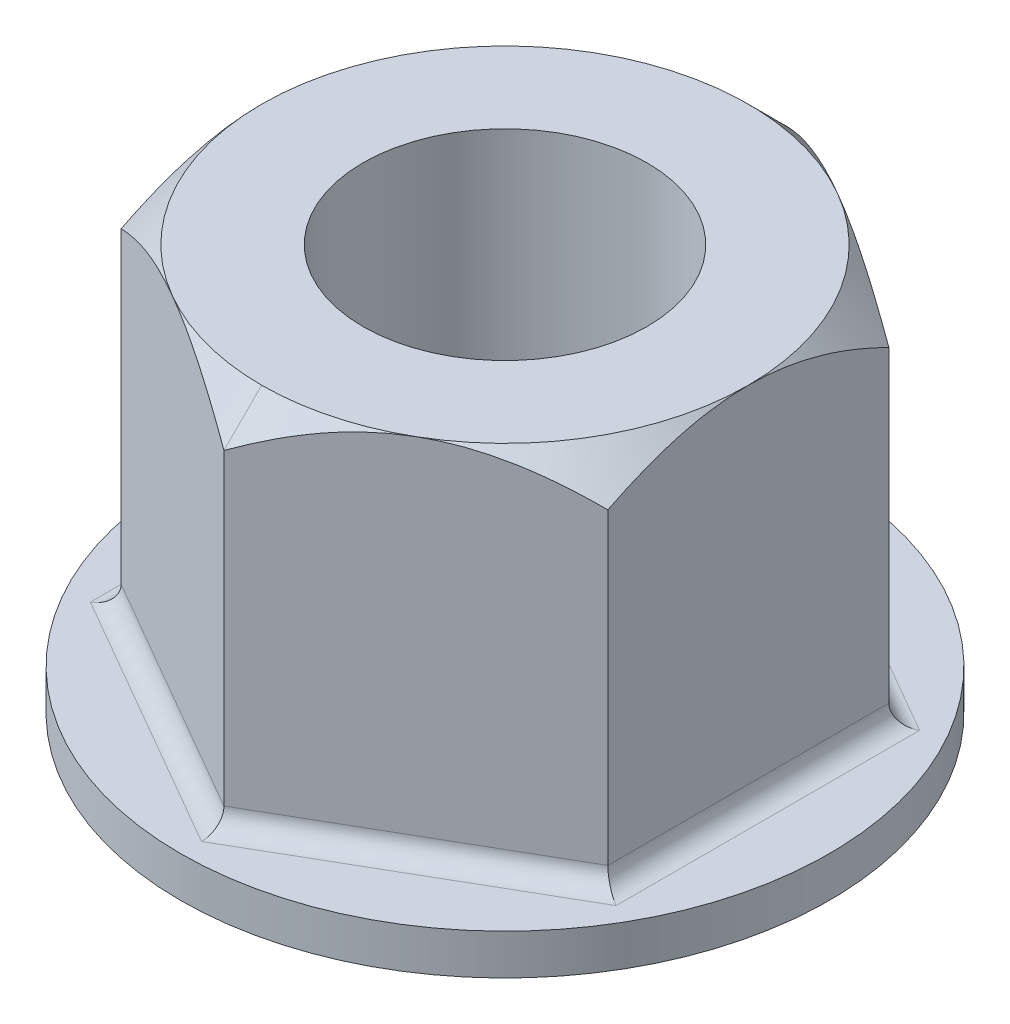
ISO-10303-21;
HEADER;
FILE_DESCRIPTION(('STEP AP214'),'2;1');
FILE_NAME('part.step','',(''),(''),'','','');
FILE_SCHEMA(('AUTOMOTIVE_DESIGN { 1 0 10303 214 1 1 1 1 }'));
ENDSEC;
DATA;
#1=APPLICATION_CONTEXT('core data for automotive mechanical design processes');
#2=APPLICATION_PROTOCOL_DEFINITION('international standard','automotive_design',2000,#1);
#3=PRODUCT_CONTEXT('',#1,'mechanical');
#4=PRODUCT('Part','Part','',(#3));
#5=PRODUCT_RELATED_PRODUCT_CATEGORY('part','',(#4));
#6=PRODUCT_DEFINITION_FORMATION('','',#4);
#7=PRODUCT_DEFINITION_CONTEXT('part definition',#1,'design');
#8=PRODUCT_DEFINITION('design','',#6,#7);
#9=PRODUCT_DEFINITION_SHAPE('','',#8);
#10=(LENGTH_UNIT() NAMED_UNIT(*) SI_UNIT(.MILLI.,.METRE.));
#11=(NAMED_UNIT(*) PLANE_ANGLE_UNIT() SI_UNIT($,.RADIAN.));
#12=(NAMED_UNIT(*) SI_UNIT($,.STERADIAN.) SOLID_ANGLE_UNIT());
#13=UNCERTAINTY_MEASURE_WITH_UNIT(LENGTH_MEASURE(1.E-05),#10,'distance_accuracy_value','');
#14=(GEOMETRIC_REPRESENTATION_CONTEXT(3) GLOBAL_UNCERTAINTY_ASSIGNED_CONTEXT((#13)) GLOBAL_UNIT_ASSIGNED_CONTEXT((#10,
#11,#12)) REPRESENTATION_CONTEXT('',''));
#15=CARTESIAN_POINT('',(0.,0.,0.));
#16=DIRECTION('',(0.,0.,1.));
#17=DIRECTION('',(1.,0.,0.));
#18=AXIS2_PLACEMENT_3D('',#15,#16,#17);
#19=CARTESIAN_POINT('',(0.,31.75,0.));
#20=DIRECTION('',(0.,1.,0.));
#21=DIRECTION('',(0.,0.,1.));
#22=AXIS2_PLACEMENT_3D('',#19,#20,#21);
#23=PLANE('',#22);
#24=CARTESIAN_POINT('',(0.,31.75,0.));
#25=DIRECTION('',(0.,1.,0.));
#26=DIRECTION('',(0.,0.,1.));
#27=AXIS2_PLACEMENT_3D('',#24,#25,#26);
#28=CIRCLE('',#27,11.1125);
#29=CARTESIAN_POINT('',(0.,31.75,11.1125));
#30=VERTEX_POINT('',#29);
#31=EDGE_CURVE('E317',#30,#30,#28,.T.);
#32=ORIENTED_EDGE('',*,*,#31,.F.);
#33=EDGE_LOOP('',(#32));
#34=FACE_BOUND('',#33,.T.);
#35=CARTESIAN_POINT('',(0.,31.75,0.));
#36=DIRECTION('',(0.,1.,0.));
#37=DIRECTION('',(0.,0.,1.));
#38=AXIS2_PLACEMENT_3D('',#35,#36,#37);
#39=CIRCLE('',#38,19.05);
#40=CARTESIAN_POINT('',(0.,31.75,19.05));
#41=VERTEX_POINT('',#40);
#42=CARTESIAN_POINT('',(9.525,31.75,16.4977839420936));
#43=VERTEX_POINT('',#42);
#44=EDGE_CURVE('E160',#41,#43,#39,.T.);
#45=ORIENTED_EDGE('',*,*,#44,.T.);
#46=CARTESIAN_POINT('',(19.05,31.75,0.));
#47=VERTEX_POINT('',#46);
#48=EDGE_CURVE('E209',#43,#47,#39,.T.);
#49=ORIENTED_EDGE('',*,*,#48,.T.);
#50=CARTESIAN_POINT('',(9.525,31.75,-16.4977839420936));
#51=VERTEX_POINT('',#50);
#52=EDGE_CURVE('E323',#47,#51,#39,.T.);
#53=ORIENTED_EDGE('',*,*,#52,.T.);
#54=CARTESIAN_POINT('',(-9.525,31.75,-16.4977839420936));
#55=VERTEX_POINT('',#54);
#56=EDGE_CURVE('E330',#51,#55,#39,.T.);
#57=ORIENTED_EDGE('',*,*,#56,.T.);
#58=CARTESIAN_POINT('',(-19.05,31.75,0.));
#59=VERTEX_POINT('',#58);
#60=EDGE_CURVE('E327',#55,#59,#39,.T.);
#61=ORIENTED_EDGE('',*,*,#60,.T.);
#62=CARTESIAN_POINT('',(-9.52500000000001,31.75,16.4977839420936));
#63=VERTEX_POINT('',#62);
#64=EDGE_CURVE('E325',#59,#63,#39,.T.);
#65=ORIENTED_EDGE('',*,*,#64,.T.);
#66=EDGE_CURVE('E145',#63,#41,#39,.T.);
#67=ORIENTED_EDGE('',*,*,#66,.T.);
#68=EDGE_LOOP('',(#45,#49,#53,#57,#61,#65,#67));
#69=FACE_BOUND('',#68,.T.);
#70=ADVANCED_FACE('F44',(#34,#69),#23,.T.);
#71=CARTESIAN_POINT('',(0.,3.175,0.));
#72=DIRECTION('',(0.,-1.,0.));
#73=DIRECTION('',(0.,0.,-1.));
#74=AXIS2_PLACEMENT_3D('',#71,#72,#73);
#75=CYLINDRICAL_SURFACE('',#74,25.4);
#76=CARTESIAN_POINT('',(0.,3.175,0.));
#77=DIRECTION('',(0.,1.,0.));
#78=DIRECTION('',(0.,0.,1.));
#79=AXIS2_PLACEMENT_3D('',#76,#77,#78);
#80=CIRCLE('',#79,25.4);
#81=CARTESIAN_POINT('',(0.,3.175,25.4));
#82=VERTEX_POINT('',#81);
#83=EDGE_CURVE('E191',#82,#82,#80,.T.);
#84=ORIENTED_EDGE('',*,*,#83,.F.);
#85=EDGE_LOOP('',(#84));
#86=FACE_BOUND('',#85,.T.);
#87=CARTESIAN_POINT('',(0.,0.,0.));
#88=DIRECTION('',(0.,1.,0.));
#89=DIRECTION('',(0.,0.,1.));
#90=AXIS2_PLACEMENT_3D('',#87,#88,#89);
#91=CIRCLE('',#90,25.4);
#92=CARTESIAN_POINT('',(0.,0.,25.4));
#93=VERTEX_POINT('',#92);
#94=EDGE_CURVE('E190',#93,#93,#91,.T.);
#95=ORIENTED_EDGE('',*,*,#94,.T.);
#96=EDGE_LOOP('',(#95));
#97=FACE_BOUND('',#96,.T.);
#98=ADVANCED_FACE('F278',(#86,#97),#75,.T.);
#99=CARTESIAN_POINT('',(0.,3.175,0.));
#100=DIRECTION('',(0.,1.,0.));
#101=DIRECTION('',(0.,0.,1.));
#102=AXIS2_PLACEMENT_3D('',#99,#100,#101);
#103=PLANE('',#102);
#104=DIRECTION('',(-0.866025403784439,0.,0.5));
#105=VECTOR('',#104,1.);
#106=CARTESIAN_POINT('',(-10.287,3.175,-17.8176066574611));
#107=LINE('',#106,#105);
#108=CARTESIAN_POINT('',(-20.574,3.175,-11.8784044383074));
#109=VERTEX_POINT('',#108);
#110=CARTESIAN_POINT('',(0.,3.175,-23.7568088766147));
#111=VERTEX_POINT('',#110);
#112=EDGE_CURVE('E364',#109,#111,#107,.F.);
#113=ORIENTED_EDGE('',*,*,#112,.T.);
#114=DIRECTION('',(-0.866025403784439,0.,-0.5));
#115=VECTOR('',#114,1.);
#116=CARTESIAN_POINT('',(10.287,3.175,-17.8176066574611));
#117=LINE('',#116,#115);
#118=CARTESIAN_POINT('',(20.574,3.175,-11.8784044383074));
#119=VERTEX_POINT('',#118);
#120=EDGE_CURVE('E367',#111,#119,#117,.F.);
#121=ORIENTED_EDGE('',*,*,#120,.T.);
#122=DIRECTION('',(0.,0.,-1.));
#123=VECTOR('',#122,1.);
#124=CARTESIAN_POINT('',(20.574,3.175,0.));
#125=LINE('',#124,#123);
#126=CARTESIAN_POINT('',(20.574,3.175,11.8784044383074));
#127=VERTEX_POINT('',#126);
#128=EDGE_CURVE('E352',#119,#127,#125,.F.);
#129=ORIENTED_EDGE('',*,*,#128,.T.);
#130=DIRECTION('',(0.866025403784439,0.,-0.5));
#131=VECTOR('',#130,1.);
#132=CARTESIAN_POINT('',(10.287,3.175,17.8176066574611));
#133=LINE('',#132,#131);
#134=CARTESIAN_POINT('',(0.,3.175,23.7568088766147));
#135=VERTEX_POINT('',#134);
#136=EDGE_CURVE('E348',#127,#135,#133,.F.);
#137=ORIENTED_EDGE('',*,*,#136,.T.);
#138=DIRECTION('',(0.866025403784439,0.,0.5));
#139=VECTOR('',#138,1.);
#140=CARTESIAN_POINT('',(-10.287,3.175,17.817606657461));
#141=LINE('',#140,#139);
#142=CARTESIAN_POINT('',(-20.574,3.175,11.8784044383074));
#143=VERTEX_POINT('',#142);
#144=EDGE_CURVE('E356',#135,#143,#141,.F.);
#145=ORIENTED_EDGE('',*,*,#144,.T.);
#146=DIRECTION('',(0.,0.,1.));
#147=VECTOR('',#146,1.);
#148=CARTESIAN_POINT('',(-20.574,3.175,0.));
#149=LINE('',#148,#147);
#150=EDGE_CURVE('E361',#143,#109,#149,.F.);
#151=ORIENTED_EDGE('',*,*,#150,.T.);
#152=EDGE_LOOP('',(#113,#121,#129,#137,#145,#151));
#153=FACE_BOUND('',#152,.T.);
#154=ORIENTED_EDGE('',*,*,#83,.T.);
#155=EDGE_LOOP('',(#154));
#156=FACE_BOUND('',#155,.T.);
#157=ADVANCED_FACE('F275',(#153,#156),#103,.T.);
#158=CARTESIAN_POINT('',(0.,0.,0.));
#159=DIRECTION('',(0.,1.,0.));
#160=DIRECTION('',(0.,0.,1.));
#161=AXIS2_PLACEMENT_3D('',#158,#159,#160);
#162=PLANE('',#161);
#163=CARTESIAN_POINT('',(0.,0.,0.));
#164=DIRECTION('',(0.,1.,0.));
#165=DIRECTION('',(0.,0.,1.));
#166=AXIS2_PLACEMENT_3D('',#163,#164,#165);
#167=CIRCLE('',#166,11.1125);
#168=CARTESIAN_POINT('',(0.,0.,11.1125));
#169=VERTEX_POINT('',#168);
#170=EDGE_CURVE('E412',#169,#169,#167,.T.);
#171=ORIENTED_EDGE('',*,*,#170,.T.);
#172=EDGE_LOOP('',(#171));
#173=FACE_BOUND('',#172,.T.);
#174=ORIENTED_EDGE('',*,*,#94,.F.);
#175=EDGE_LOOP('',(#174));
#176=FACE_BOUND('',#175,.T.);
#177=ADVANCED_FACE('F273',(#173,#176),#162,.F.);
#178=CARTESIAN_POINT('',(19.05,31.75,-10.9985226280624));
#179=DIRECTION('',(-0.5,0.,0.866025403784439));
#180=DIRECTION('',(0.866025403784439,0.,0.5));
#181=AXIS2_PLACEMENT_3D('',#178,#179,#180);
#182=PLANE('',#181);
#183=DIRECTION('',(0.,-1.,0.));
#184=VECTOR('',#183,1.);
#185=CARTESIAN_POINT('',(19.05,31.75,-10.9985226280624));
#186=LINE('',#185,#184);
#187=CARTESIAN_POINT('',(19.05,28.8029547438752,-10.9985226280624));
#188=VERTEX_POINT('',#187);
#189=CARTESIAN_POINT('',(19.05,4.699,-10.9985226280624));
#190=VERTEX_POINT('',#189);
#191=EDGE_CURVE('E179',#188,#190,#186,.T.);
#192=ORIENTED_EDGE('',*,*,#191,.T.);
#193=DIRECTION('',(-0.866025403784439,0.,-0.5));
#194=VECTOR('',#193,1.);
#195=CARTESIAN_POINT('',(19.05,4.699,-10.9985226280624));
#196=LINE('',#195,#194);
#197=CARTESIAN_POINT('',(0.,4.699,-21.9970452561248));
#198=VERTEX_POINT('',#197);
#199=EDGE_CURVE('E210',#190,#198,#196,.T.);
#200=ORIENTED_EDGE('',*,*,#199,.T.);
#201=DIRECTION('',(0.,-1.,0.));
#202=VECTOR('',#201,1.);
#203=CARTESIAN_POINT('',(0.,31.75,-21.9970452561248));
#204=LINE('',#203,#202);
#205=CARTESIAN_POINT('',(0.,28.8029547438752,-21.9970452561247));
#206=VERTEX_POINT('',#205);
#207=EDGE_CURVE('E186',#206,#198,#204,.T.);
#208=ORIENTED_EDGE('',*,*,#207,.F.);
#209=CARTESIAN_POINT('',(-0.00019999999999619,28.8028392729122,-21.9971607261786));
#210=CARTESIAN_POINT('',(0.327307732027853,28.9918962987115,-21.8080740489306));
#211=CARTESIAN_POINT('',(0.657380380364392,29.1751842269532,-21.6175065165614));
#212=CARTESIAN_POINT('',(1.32305466946838,29.5283893912222,-21.2331792865546));
#213=CARTESIAN_POINT('',(1.65865921042914,29.6982993253289,-21.0394179144896));
#214=CARTESIAN_POINT('',(2.33737928125244,30.0236355332472,-20.6475586988954));
#215=CARTESIAN_POINT('',(2.68052681344622,30.1789733121749,-20.4494423788116));
#216=CARTESIAN_POINT('',(3.37245805918866,30.4717914126347,-20.0499556878215));
#217=CARTESIAN_POINT('',(3.7212409018745,30.6092744642549,-19.8485858197081));
#218=CARTESIAN_POINT('',(4.41883366262479,30.8620334763728,-19.4458304515042));
#219=CARTESIAN_POINT('',(4.76755786914356,30.9776230809991,-19.2444944369976));
#220=CARTESIAN_POINT('',(5.46989855210758,31.1868865697012,-18.8389978546255));
#221=CARTESIAN_POINT('',(5.82351450740406,31.2805627695932,-18.6348375876453));
#222=CARTESIAN_POINT('',(6.53410992186082,31.4436454476321,-18.2245751338238));
#223=CARTESIAN_POINT('',(6.89107991548761,31.5131065748416,-18.0184784119108));
#224=CARTESIAN_POINT('',(7.60806155278002,31.626215439315,-17.604528870616));
#225=CARTESIAN_POINT('',(7.96807273380851,31.6698670335719,-17.3966763183379));
#226=CARTESIAN_POINT('',(8.58712817548344,31.7215630271627,-17.0392644924436));
#227=CARTESIAN_POINT('',(8.84577151718196,31.7362031132703,-16.8899366894898));
#228=CARTESIAN_POINT('',(9.36336376438763,31.7514270055186,-16.5911046662352));
#229=CARTESIAN_POINT('',(9.62231265319662,31.752011547173,-16.4416004555749));
#230=CARTESIAN_POINT('',(10.1400382130409,31.7391103316326,-16.1426914642325));
#231=CARTESIAN_POINT('',(10.3988147879055,31.7256194850546,-15.9932867390744));
#232=CARTESIAN_POINT('',(10.9155459764408,31.684768844215,-15.6949518482749));
#233=CARTESIAN_POINT('',(11.1735005759425,31.6574088121667,-15.5460216908139));
#234=CARTESIAN_POINT('',(11.688332666634,31.5891893810182,-15.2487832446657));
#235=CARTESIAN_POINT('',(11.9452087876488,31.5483162146379,-15.1004757470494));
#236=CARTESIAN_POINT('',(12.4571792752921,31.4536603823693,-14.8048894481915));
#237=CARTESIAN_POINT('',(12.7122734343267,31.3998762373715,-14.6576107668041));
#238=CARTESIAN_POINT('',(13.4741914374319,31.2202115855567,-14.2177172026109));
#239=CARTESIAN_POINT('',(13.9778428365935,31.0759925174332,-13.9269339317272));
#240=CARTESIAN_POINT('',(14.8717931017015,30.7793074195576,-13.410811505525));
#241=CARTESIAN_POINT('',(15.2640888283327,30.6346465439819,-13.1843194621525));
#242=CARTESIAN_POINT('',(16.0416538106179,30.3220148853287,-12.7353921103177));
#243=CARTESIAN_POINT('',(16.4269228536301,30.154043398144,-12.5129569246242));
#244=CARTESIAN_POINT('',(17.1892019617876,29.7985558495717,-12.0728548763318));
#245=CARTESIAN_POINT('',(17.5662337172492,29.6111012557993,-11.8551754908231));
#246=CARTESIAN_POINT('',(18.3133164094597,29.2191078968787,-11.4238470973684));
#247=CARTESIAN_POINT('',(18.6833714572333,29.0145796042933,-11.2101957159213));
#248=CARTESIAN_POINT('',(19.0502,28.8028392729122,-10.9984071580086));
#249=B_SPLINE_CURVE_WITH_KNOTS('',3,(#209,#210,#211,#212,#213,#214,#215,#216,#217,#218,#219,
#220,#221,#222,#223,#224,#225,#226,#227,#228,#229,#230,#231,#232,#233,#234,#235,#236,#237,#238,
#239,#240,#241,#242,#243,#244,#245,#246,#247,#248),.UNSPECIFIED.,.F.,.F.,(4,2,2,2,2,2,2,2,2,2,2,
2,2,2,2,2,2,2,2,4),(0.,1.26844596722019,2.53757954078811,3.81397944669045,5.09018395350597,
6.34643183621876,7.60254689818057,8.85580849817683,10.1088827625971,11.0056189577351,
11.9023082273929,12.7993218346277,13.6963508216572,14.5942965392257,15.4923451765124,
17.2877747306613,18.7137121331068,20.1396926159926,21.5613034713831,22.9820486660288),.UNSPECIFIED.);
#250=EDGE_CURVE('E168',#206,#51,#249,.T.);
#251=ORIENTED_EDGE('',*,*,#250,.T.);
#252=EDGE_CURVE('E236',#51,#188,#249,.T.);
#253=ORIENTED_EDGE('',*,*,#252,.T.);
#254=EDGE_LOOP('',(#192,#200,#208,#251,#253));
#255=FACE_BOUND('',#254,.T.);
#256=ADVANCED_FACE('F267',(#255),#182,.F.);
#257=CARTESIAN_POINT('',(0.,31.75,-21.9970452561248));
#258=DIRECTION('',(0.5,0.,0.866025403784439));
#259=DIRECTION('',(0.866025403784439,0.,-0.5));
#260=AXIS2_PLACEMENT_3D('',#257,#258,#259);
#261=PLANE('',#260);
#262=ORIENTED_EDGE('',*,*,#207,.T.);
#263=DIRECTION('',(-0.866025403784439,0.,0.5));
#264=VECTOR('',#263,1.);
#265=CARTESIAN_POINT('',(0.,4.699,-21.9970452561248));
#266=LINE('',#265,#264);
#267=CARTESIAN_POINT('',(-19.05,4.699,-10.9985226280624));
#268=VERTEX_POINT('',#267);
#269=EDGE_CURVE('E371',#198,#268,#266,.T.);
#270=ORIENTED_EDGE('',*,*,#269,.T.);
#271=DIRECTION('',(0.,-1.,0.));
#272=VECTOR('',#271,1.);
#273=CARTESIAN_POINT('',(-19.05,31.75,-10.9985226280624));
#274=LINE('',#273,#272);
#275=CARTESIAN_POINT('',(-19.05,28.8029547438752,-10.9985226280624));
#276=VERTEX_POINT('',#275);
#277=EDGE_CURVE('E177',#276,#268,#274,.T.);
#278=ORIENTED_EDGE('',*,*,#277,.F.);
#279=CARTESIAN_POINT('',(-19.0502,28.8028392729122,-10.9984071580085));
#280=CARTESIAN_POINT('',(-18.7226922679722,28.9918962987115,-11.1874938352565));
#281=CARTESIAN_POINT('',(-18.3926196196356,29.1751842269532,-11.3780613676257));
#282=CARTESIAN_POINT('',(-17.7269453305316,29.5283893912222,-11.7623885976325));
#283=CARTESIAN_POINT('',(-17.3913407895709,29.6982993253289,-11.9561499696975));
#284=CARTESIAN_POINT('',(-16.7126207187476,30.0236355332472,-12.3480091852917));
#285=CARTESIAN_POINT('',(-16.3694731865538,30.1789733121749,-12.5461255053756));
#286=CARTESIAN_POINT('',(-15.6775419408113,30.4717914126347,-12.9456121963657));
#287=CARTESIAN_POINT('',(-15.3287590981255,30.6092744642549,-13.1469820644791));
#288=CARTESIAN_POINT('',(-14.6311663373752,30.8620334763728,-13.549737432683));
#289=CARTESIAN_POINT('',(-14.2824421308564,30.9776230809991,-13.7510734471895));
#290=CARTESIAN_POINT('',(-13.5801014478924,31.1868865697012,-14.1565700295616));
#291=CARTESIAN_POINT('',(-13.2264854925959,31.2805627695932,-14.3607302965418));
#292=CARTESIAN_POINT('',(-12.5158900781392,31.4436454476321,-14.7709927503633));
#293=CARTESIAN_POINT('',(-12.1589200845124,31.5131065748416,-14.9770894722764));
#294=CARTESIAN_POINT('',(-11.44193844722,31.626215439315,-15.3910390135712));
#295=CARTESIAN_POINT('',(-11.0819272661915,31.6698670335719,-15.5988915658492));
#296=CARTESIAN_POINT('',(-10.4628718245166,31.7215630271627,-15.9563033917436));
#297=CARTESIAN_POINT('',(-10.204228482818,31.7362031132703,-16.1056311946973));
#298=CARTESIAN_POINT('',(-9.68663623561237,31.7514270055186,-16.404463217952));
#299=CARTESIAN_POINT('',(-9.42768734680338,31.752011547173,-16.5539674286122));
#300=CARTESIAN_POINT('',(-8.90996178695911,31.7391103316326,-16.8528764199546));
#301=CARTESIAN_POINT('',(-8.65118521209449,31.7256194850546,-17.0022811451127));
#302=CARTESIAN_POINT('',(-8.13445402355919,31.684768844215,-17.3006160359122));
#303=CARTESIAN_POINT('',(-7.87649942405754,31.6574088121667,-17.4495461933732));
#304=CARTESIAN_POINT('',(-7.36166733336605,31.5891893810182,-17.7467846395214));
#305=CARTESIAN_POINT('',(-7.10479121235116,31.5483162146379,-17.8950921371377));
#306=CARTESIAN_POINT('',(-6.59282072470793,31.4536603823693,-18.1906784359957));
#307=CARTESIAN_POINT('',(-6.33772656567326,31.3998762373715,-18.3379571173831));
#308=CARTESIAN_POINT('',(-5.57580856256813,31.2202115855567,-18.7778506815762));
#309=CARTESIAN_POINT('',(-5.07215716340653,31.0759925174332,-19.0686339524599));
#310=CARTESIAN_POINT('',(-4.17820689829847,30.7793074195576,-19.5847563786622));
#311=CARTESIAN_POINT('',(-3.78591117166731,30.6346465439819,-19.8112484220346));
#312=CARTESIAN_POINT('',(-3.00834618938205,30.3220148853287,-20.2601757738694));
#313=CARTESIAN_POINT('',(-2.62307714636987,30.154043398144,-20.4826109595629));
#314=CARTESIAN_POINT('',(-1.86079803821235,29.7985558495717,-20.9227130078553));
#315=CARTESIAN_POINT('',(-1.48376628275081,29.6111012557993,-21.1403923933641));
#316=CARTESIAN_POINT('',(-0.736683590540329,29.2191078968787,-21.5717207868187));
#317=CARTESIAN_POINT('',(-0.366628542766679,29.0145796042933,-21.7853721682658));
#318=CARTESIAN_POINT('',(0.0002000000000038,28.8028392729122,-21.9971607261786));
#319=B_SPLINE_CURVE_WITH_KNOTS('',3,(#279,#280,#281,#282,#283,#284,#285,#286,#287,#288,#289,
#290,#291,#292,#293,#294,#295,#296,#297,#298,#299,#300,#301,#302,#303,#304,#305,#306,#307,#308,
#309,#310,#311,#312,#313,#314,#315,#316,#317,#318),.UNSPECIFIED.,.F.,.F.,(4,2,2,2,2,2,2,2,2,2,2,
2,2,2,2,2,2,2,2,4),(0.,1.26844596722019,2.53757954078811,3.81397944669045,5.09018395350598,
6.34643183621876,7.60254689818057,8.85580849817684,10.1088827625971,11.0056189577351,
11.9023082273929,12.7993218346277,13.6963508216572,14.5942965392257,15.4923451765124,
17.2877747306613,18.7137121331068,20.1396926159926,21.5613034713831,22.9820486660288),.UNSPECIFIED.);
#320=EDGE_CURVE('E255',#276,#55,#319,.T.);
#321=ORIENTED_EDGE('',*,*,#320,.T.);
#322=EDGE_CURVE('E150',#55,#206,#319,.T.);
#323=ORIENTED_EDGE('',*,*,#322,.T.);
#324=EDGE_LOOP('',(#262,#270,#278,#321,#323));
#325=FACE_BOUND('',#324,.T.);
#326=ADVANCED_FACE('F263',(#325),#261,.F.);
#327=CARTESIAN_POINT('',(-19.05,31.75,-10.9985226280624));
#328=DIRECTION('',(1.,0.,0.));
#329=DIRECTION('',(0.,0.,-1.));
#330=AXIS2_PLACEMENT_3D('',#327,#328,#329);
#331=PLANE('',#330);
#332=ORIENTED_EDGE('',*,*,#277,.T.);
#333=DIRECTION('',(0.,0.,1.));
#334=VECTOR('',#333,1.);
#335=CARTESIAN_POINT('',(-19.05,4.699,-10.9985226280624));
#336=LINE('',#335,#334);
#337=CARTESIAN_POINT('',(-19.05,4.699,10.9985226280624));
#338=VERTEX_POINT('',#337);
#339=EDGE_CURVE('E374',#268,#338,#336,.T.);
#340=ORIENTED_EDGE('',*,*,#339,.T.);
#341=DIRECTION('',(0.,-1.,0.));
#342=VECTOR('',#341,1.);
#343=CARTESIAN_POINT('',(-19.05,31.75,10.9985226280624));
#344=LINE('',#343,#342);
#345=CARTESIAN_POINT('',(-19.05,28.8029547438752,10.9985226280624));
#346=VERTEX_POINT('',#345);
#347=EDGE_CURVE('E172',#346,#338,#344,.T.);
#348=ORIENTED_EDGE('',*,*,#347,.F.);
#349=CARTESIAN_POINT('',(-19.05,12.5294946835543,33.1923044872767));
#350=CARTESIAN_POINT('',(-19.05,12.9552189334449,32.7014272615447));
#351=CARTESIAN_POINT('',(-19.05,13.3796289447577,32.2094059936233));
#352=CARTESIAN_POINT('',(-19.05,14.2254353617074,31.222766508252));
#353=CARTESIAN_POINT('',(-19.05,14.6468317173346,30.7281482479418));
#354=CARTESIAN_POINT('',(-19.05,15.4864098057091,29.7357878391555));
#355=CARTESIAN_POINT('',(-19.05,15.9045899260669,29.2380443255094));
#356=CARTESIAN_POINT('',(-19.05,16.7370476772593,28.2393055127685));
#357=CARTESIAN_POINT('',(-19.05,17.1513253217994,27.7383102251043));
#358=CARTESIAN_POINT('',(-19.05,17.9848934786353,26.721071483238));
#359=CARTESIAN_POINT('',(-19.05,18.4040797703245,26.2047425498267));
#360=CARTESIAN_POINT('',(-19.05,19.2370236048341,25.1677253436637));
#361=CARTESIAN_POINT('',(-19.05,19.6507811824139,24.6470370988592));
#362=CARTESIAN_POINT('',(-19.05,20.4718681430689,23.6008089251119));
#363=CARTESIAN_POINT('',(-19.05,20.8791990188723,23.0752701691191));
#364=CARTESIAN_POINT('',(-19.05,21.6864196071038,22.0185008443416));
#365=CARTESIAN_POINT('',(-19.05,22.0863093259626,21.4872702804764));
#366=CARTESIAN_POINT('',(-19.05,22.8778060662818,20.4175435913812));
#367=CARTESIAN_POINT('',(-19.05,23.2694010831776,19.879038567266));
#368=CARTESIAN_POINT('',(-19.05,24.0420165796941,18.7944688011929));
#369=CARTESIAN_POINT('',(-19.05,24.4230369406736,18.2484039745216));
#370=CARTESIAN_POINT('',(-19.05,25.1726326450374,17.1470813596344));
#371=CARTESIAN_POINT('',(-19.05,25.5411969345844,16.5918160256891));
#372=CARTESIAN_POINT('',(-19.05,26.2627329944099,15.4712249174108));
#373=CARTESIAN_POINT('',(-19.05,26.6157051036071,14.9058993621264));
#374=CARTESIAN_POINT('',(-19.05,27.2998596659139,13.7680500509373));
#375=CARTESIAN_POINT('',(-19.05,27.631188352285,13.1956146382871));
#376=CARTESIAN_POINT('',(-19.05,28.2705524953946,12.037714305496));
#377=CARTESIAN_POINT('',(-19.05,28.5785851463216,11.4522478268289));
#378=CARTESIAN_POINT('',(-19.05,29.1652112712216,10.2677105853393));
#379=CARTESIAN_POINT('',(-19.05,29.4438478827891,9.66866136960043));
#380=CARTESIAN_POINT('',(-19.05,29.9650882633996,8.45524188436553));
#381=CARTESIAN_POINT('',(-19.05,30.2077060373552,7.84087767876468));
#382=CARTESIAN_POINT('',(-19.05,30.6538180574342,6.58179795324883));
#383=CARTESIAN_POINT('',(-19.05,30.8562813469517,5.93670923847358));
#384=CARTESIAN_POINT('',(-19.05,31.117917225201,4.95790914185407));
#385=CARTESIAN_POINT('',(-19.05,31.1981245348141,4.62975198256767));
#386=CARTESIAN_POINT('',(-19.05,31.343359448167,3.97011275305166));
#387=CARTESIAN_POINT('',(-19.05,31.4083892145953,3.63863116355823));
#388=CARTESIAN_POINT('',(-19.05,31.5218716684639,2.97489492500866));
#389=CARTESIAN_POINT('',(-19.05,31.570422150957,2.64265705088502));
#390=CARTESIAN_POINT('',(-19.05,31.6506345644038,1.97614015683078));
#391=CARTESIAN_POINT('',(-19.05,31.6822966644745,1.64186115737352));
#392=CARTESIAN_POINT('',(-19.05,31.728137735008,0.972124453277331));
#393=CARTESIAN_POINT('',(-19.05,31.742317966866,0.636666835432819));
#394=CARTESIAN_POINT('',(-19.05,31.7529242217421,-0.0345307504573962));
#395=CARTESIAN_POINT('',(-19.05,31.7493502296442,-0.370270718743248));
#396=CARTESIAN_POINT('',(-19.05,31.7245017347115,-1.041523964759));
#397=CARTESIAN_POINT('',(-19.05,31.7032044900516,-1.377036396651));
#398=CARTESIAN_POINT('',(-19.05,31.6432908690087,-2.04650231564294));
#399=CARTESIAN_POINT('',(-19.05,31.6046744298561,-2.38045579708836));
#400=CARTESIAN_POINT('',(-19.05,31.5108247190825,-3.04603531325798));
#401=CARTESIAN_POINT('',(-19.05,31.4555903978494,-3.37766119961321));
#402=CARTESIAN_POINT('',(-19.05,31.3294502987708,-4.03793491618374));
#403=CARTESIAN_POINT('',(-19.05,31.2585420172595,-4.3665822618841));
#404=CARTESIAN_POINT('',(-19.05,31.0228392648599,-5.3517969524506));
#405=CARTESIAN_POINT('',(-19.05,30.8357252295987,-6.00314162287401));
#406=CARTESIAN_POINT('',(-19.05,30.5180710334003,-6.96753583344394));
#407=CARTESIAN_POINT('',(-19.05,30.4060124151307,-7.28692082052803));
#408=CARTESIAN_POINT('',(-19.05,30.1707222694757,-7.92157342220995));
#409=CARTESIAN_POINT('',(-19.05,30.0474904667196,-8.23684093511061));
#410=CARTESIAN_POINT('',(-19.05,29.6049477710949,-9.31766126966313));
#411=CARTESIAN_POINT('',(-19.05,29.2605193842086,-10.0729835120217));
#412=CARTESIAN_POINT('',(-19.05,28.5257623142882,-11.5610616894997));
#413=CARTESIAN_POINT('',(-19.05,28.1354071027162,-12.2938042706162));
#414=CARTESIAN_POINT('',(-19.05,27.3189612165569,-13.7409671716787));
#415=CARTESIAN_POINT('',(-19.05,26.8927981783214,-14.4553463848329));
#416=CARTESIAN_POINT('',(-19.05,26.0136661703601,-15.8670943867211));
#417=CARTESIAN_POINT('',(-19.05,25.5607025470553,-16.5644665292408));
#418=CARTESIAN_POINT('',(-19.05,24.6313826856161,-17.948773055245));
#419=CARTESIAN_POINT('',(-19.05,24.1549147560117,-18.6356321122317));
#420=CARTESIAN_POINT('',(-19.05,23.1852863149414,-19.9974596592137));
#421=CARTESIAN_POINT('',(-19.05,22.69212516247,-20.6724276910872));
#422=CARTESIAN_POINT('',(-19.05,21.6930364645259,-22.0116176951508));
#423=CARTESIAN_POINT('',(-19.05,21.1871241878404,-22.6758510898048));
#424=CARTESIAN_POINT('',(-19.05,20.1645178576868,-23.9959244947932));
#425=CARTESIAN_POINT('',(-19.05,19.6478240402455,-24.6517646883634));
#426=CARTESIAN_POINT('',(-19.05,18.5889123769298,-25.9772124706634));
#427=CARTESIAN_POINT('',(-19.05,18.0464066738272,-26.6465897198248));
#428=CARTESIAN_POINT('',(-19.05,16.9535024513279,-27.9790645508179));
#429=CARTESIAN_POINT('',(-19.05,16.4031025121491,-28.6421609665099));
#430=CARTESIAN_POINT('',(-19.05,15.301793795725,-29.9557530774736));
#431=CARTESIAN_POINT('',(-19.05,14.7509549487006,-30.6063074839474));
#432=CARTESIAN_POINT('',(-19.05,13.6439851568323,-31.9026582301359));
#433=CARTESIAN_POINT('',(-19.05,13.0878553764953,-32.5484555637701));
#434=CARTESIAN_POINT('',(-19.05,12.5294946835543,-33.1923044872767));
#435=B_SPLINE_CURVE_WITH_KNOTS('',3,(#349,#350,#351,#352,#353,#354,#355,#356,#357,#358,#359,
#360,#361,#362,#363,#364,#365,#366,#367,#368,#369,#370,#371,#372,#373,#374,#375,#376,#377,#378,
#379,#380,#381,#382,#383,#384,#385,#386,#387,#388,#389,#390,#391,#392,#393,#394,#395,#396,#397,
#398,#399,#400,#401,#402,#403,#404,#405,#406,#407,#408,#409,#410,#411,#412,#413,#414,#415,#416,
#417,#418,#419,#420,#421,#422,#423,#424,#425,#426,#427,#428,#429,#430,#431,#432,#433,#434),
.UNSPECIFIED.,.F.,.F.,(4,2,2,2,2,2,2,2,2,2,2,2,2,2,2,2,2,2,2,2,2,2,2,2,2,2,2,2,2,2,2,2,2,2,2,2,
2,2,2,2,2,2,4),(0.,1.94931365113644,3.89865957519027,5.84892624197679,7.79918605687642,
9.79435231431894,11.7895057907423,13.7841888210244,15.77887012741,17.7762642983251,
19.7736808697125,21.772825786872,23.7719272283109,25.755711239257,27.7397338010487,
29.7208031545219,31.7011001960054,33.7270531555193,34.7402074822692,35.7532173536953,
36.7601059585486,37.7669844804265,38.7737903472424,39.7805970712521,40.7886976881764,
41.7968019587735,42.8049699162216,43.8132990289731,45.8435365282206,46.858811271719,
47.8741110441618,50.362239261959,52.8518118098275,55.3465424335423,57.8407770530906,
60.3482894239223,62.8558981905687,65.3606348933254,67.8653168204743,70.4500877840155,
73.0353295989272,75.5926016055871,78.1493232237142),.UNSPECIFIED.);
#436=EDGE_CURVE('E417',#346,#59,#435,.T.);
#437=ORIENTED_EDGE('',*,*,#436,.T.);
#438=EDGE_CURVE('E256',#59,#276,#435,.T.);
#439=ORIENTED_EDGE('',*,*,#438,.T.);
#440=EDGE_LOOP('',(#332,#340,#348,#437,#439));
#441=FACE_BOUND('',#440,.T.);
#442=ADVANCED_FACE('F266',(#441),#331,.F.);
#443=CARTESIAN_POINT('',(-19.05,31.75,10.9985226280624));
#444=DIRECTION('',(0.5,0.,-0.866025403784439));
#445=DIRECTION('',(-0.866025403784439,0.,-0.5));
#446=AXIS2_PLACEMENT_3D('',#443,#444,#445);
#447=PLANE('',#446);
#448=ORIENTED_EDGE('',*,*,#347,.T.);
#449=DIRECTION('',(0.866025403784439,0.,0.5));
#450=VECTOR('',#449,1.);
#451=CARTESIAN_POINT('',(-19.05,4.699,10.9985226280624));
#452=LINE('',#451,#450);
#453=CARTESIAN_POINT('',(0.,4.699,21.9970452561247));
#454=VERTEX_POINT('',#453);
#455=EDGE_CURVE('E68',#338,#454,#452,.T.);
#456=ORIENTED_EDGE('',*,*,#455,.T.);
#457=DIRECTION('',(0.,-1.,0.));
#458=VECTOR('',#457,1.);
#459=CARTESIAN_POINT('',(0.,31.75,21.9970452561247));
#460=LINE('',#459,#458);
#461=CARTESIAN_POINT('',(0.,28.8029547438752,21.9970452561247));
#462=VERTEX_POINT('',#461);
#463=EDGE_CURVE('E164',#462,#454,#460,.T.);
#464=ORIENTED_EDGE('',*,*,#463,.F.);
#465=CARTESIAN_POINT('',(0.000199999999995674,28.8028392729122,21.9971607261786));
#466=CARTESIAN_POINT('',(-0.327307732027853,28.9918962987115,21.8080740489306));
#467=CARTESIAN_POINT('',(-0.657380380364391,29.1751842269532,21.6175065165614));
#468=CARTESIAN_POINT('',(-1.32305466946838,29.5283893912222,21.2331792865546));
#469=CARTESIAN_POINT('',(-1.65865921042914,29.6982993253289,21.0394179144896));
#470=CARTESIAN_POINT('',(-2.33737928125244,30.0236355332472,20.6475586988954));
#471=CARTESIAN_POINT('',(-2.68052681344621,30.1789733121749,20.4494423788116));
#472=CARTESIAN_POINT('',(-3.37245805918866,30.4717914126347,20.0499556878215));
#473=CARTESIAN_POINT('',(-3.7212409018745,30.6092744642549,19.8485858197081));
#474=CARTESIAN_POINT('',(-4.41883366262479,30.8620334763728,19.4458304515041));
#475=CARTESIAN_POINT('',(-4.76755786914355,30.9776230809991,19.2444944369976));
#476=CARTESIAN_POINT('',(-5.46989855210758,31.1868865697012,18.8389978546255));
#477=CARTESIAN_POINT('',(-5.82351450740406,31.2805627695932,18.6348375876453));
#478=CARTESIAN_POINT('',(-6.53410992186082,31.4436454476321,18.2245751338238));
#479=CARTESIAN_POINT('',(-6.89107991548761,31.5131065748416,18.0184784119108));
#480=CARTESIAN_POINT('',(-7.60806155278002,31.626215439315,17.604528870616));
#481=CARTESIAN_POINT('',(-7.96807273380851,31.6698670335719,17.3966763183379));
#482=CARTESIAN_POINT('',(-8.58712817548344,31.7215630271627,17.0392644924436));
#483=CARTESIAN_POINT('',(-8.84577151718196,31.7362031132703,16.8899366894898));
#484=CARTESIAN_POINT('',(-9.36336376438763,31.7514270055186,16.5911046662352));
#485=CARTESIAN_POINT('',(-9.62231265319661,31.752011547173,16.4416004555749));
#486=CARTESIAN_POINT('',(-10.1400382130409,31.7391103316326,16.1426914642325));
#487=CARTESIAN_POINT('',(-10.3988147879055,31.7256194850546,15.9932867390744));
#488=CARTESIAN_POINT('',(-10.9155459764408,31.684768844215,15.6949518482749));
#489=CARTESIAN_POINT('',(-11.1735005759425,31.6574088121667,15.5460216908139));
#490=CARTESIAN_POINT('',(-11.688332666634,31.5891893810182,15.2487832446657));
#491=CARTESIAN_POINT('',(-11.9452087876488,31.548316214638,15.1004757470494));
#492=CARTESIAN_POINT('',(-12.4571792752921,31.4536603823693,14.8048894481914));
#493=CARTESIAN_POINT('',(-12.7122734343267,31.3998762373715,14.6576107668041));
#494=CARTESIAN_POINT('',(-13.4741914374319,31.2202115855567,14.2177172026109));
#495=CARTESIAN_POINT('',(-13.9778428365935,31.0759925174332,13.9269339317272));
#496=CARTESIAN_POINT('',(-14.8717931017015,30.7793074195576,13.410811505525));
#497=CARTESIAN_POINT('',(-15.2640888283327,30.6346465439819,13.1843194621525));
#498=CARTESIAN_POINT('',(-16.0416538106179,30.3220148853287,12.7353921103177));
#499=CARTESIAN_POINT('',(-16.4269228536301,30.154043398144,12.5129569246242));
#500=CARTESIAN_POINT('',(-17.1892019617876,29.7985558495717,12.0728548763318));
#501=CARTESIAN_POINT('',(-17.5662337172492,29.6111012557993,11.855175490823));
#502=CARTESIAN_POINT('',(-18.3133164094597,29.2191078968787,11.4238470973684));
#503=CARTESIAN_POINT('',(-18.6833714572333,29.0145796042933,11.2101957159213));
#504=CARTESIAN_POINT('',(-19.0502,28.8028392729122,10.9984071580085));
#505=B_SPLINE_CURVE_WITH_KNOTS('',3,(#465,#466,#467,#468,#469,#470,#471,#472,#473,#474,#475,
#476,#477,#478,#479,#480,#481,#482,#483,#484,#485,#486,#487,#488,#489,#490,#491,#492,#493,#494,
#495,#496,#497,#498,#499,#500,#501,#502,#503,#504),.UNSPECIFIED.,.F.,.F.,(4,2,2,2,2,2,2,2,2,2,2,
2,2,2,2,2,2,2,2,4),(0.,1.26844596722019,2.53757954078811,3.81397944669045,5.09018395350598,
6.34643183621876,7.60254689818057,8.85580849817683,10.1088827625971,11.0056189577351,
11.9023082273929,12.7993218346277,13.6963508216572,14.5942965392257,15.4923451765124,
17.2877747306613,18.7137121331068,20.1396926159926,21.5613034713831,22.9820486660288),.UNSPECIFIED.);
#506=EDGE_CURVE('E139',#462,#63,#505,.T.);
#507=ORIENTED_EDGE('',*,*,#506,.T.);
#508=EDGE_CURVE('E153',#63,#346,#505,.T.);
#509=ORIENTED_EDGE('',*,*,#508,.T.);
#510=EDGE_LOOP('',(#448,#456,#464,#507,#509));
#511=FACE_BOUND('',#510,.T.);
#512=ADVANCED_FACE('F170',(#511),#447,.F.);
#513=CARTESIAN_POINT('',(0.,31.75,21.9970452561247));
#514=DIRECTION('',(-0.5,0.,-0.866025403784439));
#515=DIRECTION('',(-0.866025403784439,0.,0.5));
#516=AXIS2_PLACEMENT_3D('',#513,#514,#515);
#517=PLANE('',#516);
#518=ORIENTED_EDGE('',*,*,#463,.T.);
#519=DIRECTION('',(0.866025403784439,0.,-0.5));
#520=VECTOR('',#519,1.);
#521=CARTESIAN_POINT('',(0.,4.699,21.9970452561247));
#522=LINE('',#521,#520);
#523=CARTESIAN_POINT('',(19.05,4.699,10.9985226280624));
#524=VERTEX_POINT('',#523);
#525=EDGE_CURVE('E11',#454,#524,#522,.T.);
#526=ORIENTED_EDGE('',*,*,#525,.T.);
#527=DIRECTION('',(0.,-1.,0.));
#528=VECTOR('',#527,1.);
#529=CARTESIAN_POINT('',(19.05,31.75,10.9985226280624));
#530=LINE('',#529,#528);
#531=CARTESIAN_POINT('',(19.05,28.8029547438752,10.9985226280624));
#532=VERTEX_POINT('',#531);
#533=EDGE_CURVE('E173',#532,#524,#530,.T.);
#534=ORIENTED_EDGE('',*,*,#533,.F.);
#535=CARTESIAN_POINT('',(19.0502,28.8028392729122,10.9984071580085));
#536=CARTESIAN_POINT('',(18.7226922679721,28.9918962987115,11.1874938352565));
#537=CARTESIAN_POINT('',(18.3926196196356,29.1751842269532,11.3780613676257));
#538=CARTESIAN_POINT('',(17.7269453305316,29.5283893912222,11.7623885976325));
#539=CARTESIAN_POINT('',(17.3913407895709,29.6982993253289,11.9561499696975));
#540=CARTESIAN_POINT('',(16.7126207187476,30.0236355332472,12.3480091852917));
#541=CARTESIAN_POINT('',(16.3694731865538,30.1789733121749,12.5461255053756));
#542=CARTESIAN_POINT('',(15.6775419408113,30.4717914126347,12.9456121963657));
#543=CARTESIAN_POINT('',(15.3287590981255,30.6092744642549,13.1469820644791));
#544=CARTESIAN_POINT('',(14.6311663373752,30.8620334763728,13.549737432683));
#545=CARTESIAN_POINT('',(14.2824421308564,30.9776230809991,13.7510734471895));
#546=CARTESIAN_POINT('',(13.5801014478924,31.1868865697012,14.1565700295616));
#547=CARTESIAN_POINT('',(13.2264854925959,31.2805627695932,14.3607302965418));
#548=CARTESIAN_POINT('',(12.5158900781392,31.4436454476321,14.7709927503633));
#549=CARTESIAN_POINT('',(12.1589200845124,31.5131065748416,14.9770894722764));
#550=CARTESIAN_POINT('',(11.44193844722,31.626215439315,15.3910390135712));
#551=CARTESIAN_POINT('',(11.0819272661915,31.6698670335719,15.5988915658492));
#552=CARTESIAN_POINT('',(10.4628718245166,31.7215630271627,15.9563033917436));
#553=CARTESIAN_POINT('',(10.204228482818,31.7362031132703,16.1056311946973));
#554=CARTESIAN_POINT('',(9.68663623561237,31.7514270055186,16.404463217952));
#555=CARTESIAN_POINT('',(9.42768734680338,31.752011547173,16.5539674286122));
#556=CARTESIAN_POINT('',(8.9099617869591,31.7391103316326,16.8528764199546));
#557=CARTESIAN_POINT('',(8.65118521209449,31.7256194850546,17.0022811451127));
#558=CARTESIAN_POINT('',(8.13445402355918,31.684768844215,17.3006160359122));
#559=CARTESIAN_POINT('',(7.87649942405754,31.6574088121667,17.4495461933732));
#560=CARTESIAN_POINT('',(7.36166733336604,31.5891893810182,17.7467846395214));
#561=CARTESIAN_POINT('',(7.10479121235116,31.5483162146379,17.8950921371377));
#562=CARTESIAN_POINT('',(6.59282072470792,31.4536603823693,18.1906784359957));
#563=CARTESIAN_POINT('',(6.33772656567325,31.3998762373715,18.3379571173831));
#564=CARTESIAN_POINT('',(5.57580856256812,31.2202115855567,18.7778506815762));
#565=CARTESIAN_POINT('',(5.07215716340653,31.0759925174332,19.0686339524599));
#566=CARTESIAN_POINT('',(4.17820689829847,30.7793074195576,19.5847563786622));
#567=CARTESIAN_POINT('',(3.7859111716673,30.6346465439819,19.8112484220346));
#568=CARTESIAN_POINT('',(3.00834618938205,30.3220148853287,20.2601757738694));
#569=CARTESIAN_POINT('',(2.62307714636987,30.154043398144,20.4826109595629));
#570=CARTESIAN_POINT('',(1.86079803821235,29.7985558495717,20.9227130078553));
#571=CARTESIAN_POINT('',(1.48376628275081,29.6111012557993,21.1403923933641));
#572=CARTESIAN_POINT('',(0.736683590540327,29.2191078968787,21.5717207868187));
#573=CARTESIAN_POINT('',(0.366628542766676,29.0145796042933,21.7853721682658));
#574=CARTESIAN_POINT('',(-0.000200000000003811,28.8028392729122,21.9971607261786));
#575=B_SPLINE_CURVE_WITH_KNOTS('',3,(#535,#536,#537,#538,#539,#540,#541,#542,#543,#544,#545,
#546,#547,#548,#549,#550,#551,#552,#553,#554,#555,#556,#557,#558,#559,#560,#561,#562,#563,#564,
#565,#566,#567,#568,#569,#570,#571,#572,#573,#574),.UNSPECIFIED.,.F.,.F.,(4,2,2,2,2,2,2,2,2,2,2,
2,2,2,2,2,2,2,2,4),(0.,1.26844596722019,2.53757954078811,3.81397944669045,5.09018395350598,
6.34643183621876,7.60254689818057,8.85580849817683,10.1088827625971,11.0056189577351,
11.9023082273929,12.7993218346277,13.6963508216572,14.5942965392257,15.4923451765124,
17.2877747306613,18.7137121331068,20.1396926159926,21.5613034713831,22.9820486660288),.UNSPECIFIED.);
#576=EDGE_CURVE('E166',#532,#43,#575,.T.);
#577=ORIENTED_EDGE('',*,*,#576,.T.);
#578=EDGE_CURVE('E151',#43,#462,#575,.T.);
#579=ORIENTED_EDGE('',*,*,#578,.T.);
#580=EDGE_LOOP('',(#518,#526,#534,#577,#579));
#581=FACE_BOUND('',#580,.T.);
#582=ADVANCED_FACE('F163',(#581),#517,.F.);
#583=CARTESIAN_POINT('',(19.05,31.75,10.9985226280624));
#584=DIRECTION('',(-1.,0.,0.));
#585=DIRECTION('',(0.,0.,1.));
#586=AXIS2_PLACEMENT_3D('',#583,#584,#585);
#587=PLANE('',#586);
#588=ORIENTED_EDGE('',*,*,#533,.T.);
#589=DIRECTION('',(0.,0.,-1.));
#590=VECTOR('',#589,1.);
#591=CARTESIAN_POINT('',(19.05,4.699,10.9985226280624));
#592=LINE('',#591,#590);
#593=EDGE_CURVE('E54',#524,#190,#592,.T.);
#594=ORIENTED_EDGE('',*,*,#593,.T.);
#595=ORIENTED_EDGE('',*,*,#191,.F.);
#596=CARTESIAN_POINT('',(19.05,12.5294946835543,-33.1923044872768));
#597=CARTESIAN_POINT('',(19.05,12.9552189334448,-32.7014272615447));
#598=CARTESIAN_POINT('',(19.05,13.3796289447577,-32.2094059936233));
#599=CARTESIAN_POINT('',(19.05,14.2254353617074,-31.2227665082521));
#600=CARTESIAN_POINT('',(19.05,14.6468317173346,-30.7281482479419));
#601=CARTESIAN_POINT('',(19.05,15.4864098057091,-29.7357878391556));
#602=CARTESIAN_POINT('',(19.05,15.9045899260668,-29.2380443255094));
#603=CARTESIAN_POINT('',(19.05,16.7370476772592,-28.2393055127685));
#604=CARTESIAN_POINT('',(19.05,17.1513253217994,-27.7383102251044));
#605=CARTESIAN_POINT('',(19.05,17.9848934786353,-26.721071483238));
#606=CARTESIAN_POINT('',(19.05,18.4040797703245,-26.2047425498267));
#607=CARTESIAN_POINT('',(19.05,19.2370236048341,-25.1677253436638));
#608=CARTESIAN_POINT('',(19.05,19.6507811824139,-24.6470370988592));
#609=CARTESIAN_POINT('',(19.05,20.4718681430689,-23.6008089251119));
#610=CARTESIAN_POINT('',(19.05,20.8791990188723,-23.0752701691191));
#611=CARTESIAN_POINT('',(19.05,21.6864196071037,-22.0185008443416));
#612=CARTESIAN_POINT('',(19.05,22.0863093259625,-21.4872702804764));
#613=CARTESIAN_POINT('',(19.05,22.8778060662818,-20.4175435913812));
#614=CARTESIAN_POINT('',(19.05,23.2694010831776,-19.879038567266));
#615=CARTESIAN_POINT('',(19.05,24.0420165796941,-18.7944688011929));
#616=CARTESIAN_POINT('',(19.05,24.4230369406736,-18.2484039745217));
#617=CARTESIAN_POINT('',(19.05,25.1726326450374,-17.1470813596344));
#618=CARTESIAN_POINT('',(19.05,25.5411969345844,-16.5918160256891));
#619=CARTESIAN_POINT('',(19.05,26.2627329944099,-15.4712249174108));
#620=CARTESIAN_POINT('',(19.05,26.615705103607,-14.9058993621264));
#621=CARTESIAN_POINT('',(19.05,27.2998596659139,-13.7680500509374));
#622=CARTESIAN_POINT('',(19.05,27.631188352285,-13.1956146382871));
#623=CARTESIAN_POINT('',(19.05,28.2705524953946,-12.037714305496));
#624=CARTESIAN_POINT('',(19.05,28.5785851463216,-11.4522478268289));
#625=CARTESIAN_POINT('',(19.05,29.1652112712216,-10.2677105853393));
#626=CARTESIAN_POINT('',(19.05,29.4438478827891,-9.66866136960046));
#627=CARTESIAN_POINT('',(19.05,29.9650882633995,-8.45524188436556));
#628=CARTESIAN_POINT('',(19.05,30.2077060373552,-7.84087767876471));
#629=CARTESIAN_POINT('',(19.05,30.6538180574342,-6.58179795324886));
#630=CARTESIAN_POINT('',(19.05,30.8562813469517,-5.93670923847361));
#631=CARTESIAN_POINT('',(19.05,31.117917225201,-4.9579091418541));
#632=CARTESIAN_POINT('',(19.05,31.1981245348141,-4.62975198256771));
#633=CARTESIAN_POINT('',(19.05,31.343359448167,-3.97011275305169));
#634=CARTESIAN_POINT('',(19.05,31.4083892145953,-3.63863116355827));
#635=CARTESIAN_POINT('',(19.05,31.5218716684639,-2.9748949250087));
#636=CARTESIAN_POINT('',(19.05,31.570422150957,-2.64265705088506));
#637=CARTESIAN_POINT('',(19.05,31.6506345644038,-1.97614015683081));
#638=CARTESIAN_POINT('',(19.05,31.6822966644745,-1.64186115737354));
#639=CARTESIAN_POINT('',(19.05,31.728137735008,-0.97212445327736));
#640=CARTESIAN_POINT('',(19.05,31.742317966866,-0.636666835432848));
#641=CARTESIAN_POINT('',(19.05,31.7529242217421,0.0345307504573694));
#642=CARTESIAN_POINT('',(19.05,31.7493502296442,0.370270718743224));
#643=CARTESIAN_POINT('',(19.05,31.7245017347115,1.04152396475898));
#644=CARTESIAN_POINT('',(19.05,31.7032044900516,1.37703639665098));
#645=CARTESIAN_POINT('',(19.05,31.6432908690087,2.04650231564292));
#646=CARTESIAN_POINT('',(19.05,31.6046744298561,2.38045579708835));
#647=CARTESIAN_POINT('',(19.05,31.5108247190825,3.04603531325797));
#648=CARTESIAN_POINT('',(19.05,31.4555903978495,3.3776611996132));
#649=CARTESIAN_POINT('',(19.05,31.3294502987708,4.03793491618372));
#650=CARTESIAN_POINT('',(19.05,31.2585420172595,4.36658226188408));
#651=CARTESIAN_POINT('',(19.05,31.0228392648599,5.35179695245058));
#652=CARTESIAN_POINT('',(19.05,30.8357252295987,6.003141622874));
#653=CARTESIAN_POINT('',(19.05,30.5180710334003,6.96753583344393));
#654=CARTESIAN_POINT('',(19.05,30.4060124151307,7.28692082052802));
#655=CARTESIAN_POINT('',(19.05,30.1707222694758,7.92157342220994));
#656=CARTESIAN_POINT('',(19.05,30.0474904667196,8.2368409351106));
#657=CARTESIAN_POINT('',(19.05,29.6049477710949,9.31766126966312));
#658=CARTESIAN_POINT('',(19.05,29.2605193842086,10.0729835120217));
#659=CARTESIAN_POINT('',(19.05,28.5257623142882,11.5610616894996));
#660=CARTESIAN_POINT('',(19.05,28.1354071027163,12.2938042706162));
#661=CARTESIAN_POINT('',(19.05,27.3189612165569,13.7409671716786));
#662=CARTESIAN_POINT('',(19.05,26.8927981783214,14.4553463848329));
#663=CARTESIAN_POINT('',(19.05,26.0136661703601,15.867094386721));
#664=CARTESIAN_POINT('',(19.05,25.5607025470553,16.5644665292408));
#665=CARTESIAN_POINT('',(19.05,24.6313826856161,17.948773055245));
#666=CARTESIAN_POINT('',(19.05,24.1549147560117,18.6356321122317));
#667=CARTESIAN_POINT('',(19.05,23.1852863149415,19.9974596592137));
#668=CARTESIAN_POINT('',(19.05,22.6921251624701,20.6724276910871));
#669=CARTESIAN_POINT('',(19.05,21.693036464526,22.0116176951508));
#670=CARTESIAN_POINT('',(19.05,21.1871241878404,22.6758510898047));
#671=CARTESIAN_POINT('',(19.05,20.1645178576869,23.9959244947931));
#672=CARTESIAN_POINT('',(19.05,19.6478240402455,24.6517646883633));
#673=CARTESIAN_POINT('',(19.05,18.5889123769299,25.9772124706633));
#674=CARTESIAN_POINT('',(19.05,18.0464066738272,26.6465897198247));
#675=CARTESIAN_POINT('',(19.05,16.9535024513279,27.9790645508179));
#676=CARTESIAN_POINT('',(19.05,16.4031025121492,28.6421609665099));
#677=CARTESIAN_POINT('',(19.05,15.301793795725,29.9557530774736));
#678=CARTESIAN_POINT('',(19.05,14.7509549487006,30.6063074839474));
#679=CARTESIAN_POINT('',(19.05,13.6439851568323,31.9026582301359));
#680=CARTESIAN_POINT('',(19.05,13.0878553764953,32.5484555637701));
#681=CARTESIAN_POINT('',(19.05,12.5294946835543,33.1923044872768));
#682=B_SPLINE_CURVE_WITH_KNOTS('',3,(#596,#597,#598,#599,#600,#601,#602,#603,#604,#605,#606,
#607,#608,#609,#610,#611,#612,#613,#614,#615,#616,#617,#618,#619,#620,#621,#622,#623,#624,#625,
#626,#627,#628,#629,#630,#631,#632,#633,#634,#635,#636,#637,#638,#639,#640,#641,#642,#643,#644,
#645,#646,#647,#648,#649,#650,#651,#652,#653,#654,#655,#656,#657,#658,#659,#660,#661,#662,#663,
#664,#665,#666,#667,#668,#669,#670,#671,#672,#673,#674,#675,#676,#677,#678,#679,#680,#681),
.UNSPECIFIED.,.F.,.F.,(4,2,2,2,2,2,2,2,2,2,2,2,2,2,2,2,2,2,2,2,2,2,2,2,2,2,2,2,2,2,2,2,2,2,2,2,
2,2,2,2,2,2,4),(0.,1.94931365113644,3.89865957519026,5.84892624197678,7.79918605687642,
9.79435231431893,11.7895057907423,13.7841888210244,15.77887012741,17.7762642983251,
19.7736808697125,21.772825786872,23.7719272283109,25.755711239257,27.7397338010487,
29.7208031545219,31.7011001960054,33.7270531555193,34.7402074822692,35.7532173536952,
36.7601059585486,37.7669844804265,38.7737903472424,39.7805970712521,40.7886976881764,
41.7968019587735,42.8049699162216,43.8132990289731,45.8435365282206,46.858811271719,
47.8741110441619,50.362239261959,52.8518118098275,55.3465424335423,57.8407770530906,
60.3482894239223,62.8558981905687,65.3606348933253,67.8653168204743,70.4500877840155,
73.0353295989272,75.5926016055872,78.1493232237142),.UNSPECIFIED.);
#683=EDGE_CURVE('E208',#188,#47,#682,.T.);
#684=ORIENTED_EDGE('',*,*,#683,.T.);
#685=EDGE_CURVE('E198',#47,#532,#682,.T.);
#686=ORIENTED_EDGE('',*,*,#685,.T.);
#687=EDGE_LOOP('',(#588,#594,#595,#684,#686));
#688=FACE_BOUND('',#687,.T.);
#689=ADVANCED_FACE('F212',(#688),#587,.F.);
#690=CARTESIAN_POINT('',(0.,31.75,0.));
#691=DIRECTION('',(0.,1.,0.));
#692=DIRECTION('',(0.,0.,1.));
#693=AXIS2_PLACEMENT_3D('',#690,#691,#692);
#694=CYLINDRICAL_SURFACE('',#693,11.1125);
#695=ORIENTED_EDGE('',*,*,#170,.F.);
#696=EDGE_LOOP('',(#695));
#697=FACE_BOUND('',#696,.T.);
#698=ORIENTED_EDGE('',*,*,#31,.T.);
#699=EDGE_LOOP('',(#698));
#700=FACE_BOUND('',#699,.T.);
#701=ADVANCED_FACE('F223',(#697,#700),#694,.F.);
#702=CARTESIAN_POINT('',(0.,28.8029547438752,0.));
#703=DIRECTION('',(0.,-1.,0.));
#704=DIRECTION('',(0.,0.,-1.));
#705=AXIS2_PLACEMENT_3D('',#702,#703,#704);
#706=CONICAL_SURFACE('',#705,21.9970452561247,0.785398163397447);
#707=ORIENTED_EDGE('',*,*,#685,.F.);
#708=ORIENTED_EDGE('',*,*,#48,.F.);
#709=ORIENTED_EDGE('',*,*,#576,.F.);
#710=EDGE_LOOP('',(#707,#708,#709));
#711=FACE_BOUND('',#710,.T.);
#712=ADVANCED_FACE('F222',(#711),#706,.T.);
#713=ORIENTED_EDGE('',*,*,#52,.F.);
#714=ORIENTED_EDGE('',*,*,#683,.F.);
#715=ORIENTED_EDGE('',*,*,#252,.F.);
#716=EDGE_LOOP('',(#713,#714,#715));
#717=FACE_BOUND('',#716,.T.);
#718=ADVANCED_FACE('F337',(#717),#706,.T.);
#719=ORIENTED_EDGE('',*,*,#44,.F.);
#720=DIRECTION('',(0.,0.707106781186548,-0.707106781186547));
#721=VECTOR('',#720,1.);
#722=CARTESIAN_POINT('',(0.,28.8029547438752,21.9970452561247));
#723=LINE('',#722,#721);
#724=EDGE_CURVE('E142',#462,#41,#723,.T.);
#725=ORIENTED_EDGE('',*,*,#724,.F.);
#726=ORIENTED_EDGE('',*,*,#578,.F.);
#727=EDGE_LOOP('',(#719,#725,#726));
#728=FACE_BOUND('',#727,.T.);
#729=ADVANCED_FACE('F157',(#728),#706,.T.);
#730=ORIENTED_EDGE('',*,*,#724,.T.);
#731=ORIENTED_EDGE('',*,*,#66,.F.);
#732=ORIENTED_EDGE('',*,*,#506,.F.);
#733=EDGE_LOOP('',(#730,#731,#732));
#734=FACE_BOUND('',#733,.T.);
#735=ADVANCED_FACE('F141',(#734),#706,.T.);
#736=ORIENTED_EDGE('',*,*,#508,.F.);
#737=ORIENTED_EDGE('',*,*,#64,.F.);
#738=ORIENTED_EDGE('',*,*,#436,.F.);
#739=EDGE_LOOP('',(#736,#737,#738));
#740=FACE_BOUND('',#739,.T.);
#741=ADVANCED_FACE('F216',(#740),#706,.T.);
#742=ORIENTED_EDGE('',*,*,#60,.F.);
#743=ORIENTED_EDGE('',*,*,#320,.F.);
#744=ORIENTED_EDGE('',*,*,#438,.F.);
#745=EDGE_LOOP('',(#742,#743,#744));
#746=FACE_BOUND('',#745,.T.);
#747=ADVANCED_FACE('F220',(#746),#706,.T.);
#748=ORIENTED_EDGE('',*,*,#56,.F.);
#749=ORIENTED_EDGE('',*,*,#250,.F.);
#750=ORIENTED_EDGE('',*,*,#322,.F.);
#751=EDGE_LOOP('',(#748,#749,#750));
#752=FACE_BOUND('',#751,.T.);
#753=ADVANCED_FACE('F307',(#752),#706,.T.);
#754=CARTESIAN_POINT('',(-19.812,4.699,12.3183453434299));
#755=DIRECTION('',(0.866025403784439,0.,0.5));
#756=DIRECTION('',(0.5,0.,-0.866025403784439));
#757=AXIS2_PLACEMENT_3D('',#754,#755,#756);
#758=CYLINDRICAL_SURFACE('',#757,1.524);
#759=CARTESIAN_POINT('',(-20.574,4.699,11.8784044383074));
#760=DIRECTION('',(0.5,0.,0.866025403784439));
#761=DIRECTION('',(0.866025403784439,0.,-0.5));
#762=AXIS2_PLACEMENT_3D('',#759,#760,#761);
#763=ELLIPSE('',#762,1.75976362048998,1.524);
#764=EDGE_CURVE('E394',#143,#338,#763,.T.);
#765=ORIENTED_EDGE('',*,*,#764,.F.);
#766=ORIENTED_EDGE('',*,*,#144,.F.);
#767=CARTESIAN_POINT('',(0.,4.699,23.7568088766147));
#768=DIRECTION('',(1.,0.,0.));
#769=DIRECTION('',(0.,0.,-1.));
#770=AXIS2_PLACEMENT_3D('',#767,#768,#769);
#771=ELLIPSE('',#770,1.75976362048998,1.524);
#772=EDGE_CURVE('E48',#454,#135,#771,.F.);
#773=ORIENTED_EDGE('',*,*,#772,.F.);
#774=ORIENTED_EDGE('',*,*,#455,.F.);
#775=EDGE_LOOP('',(#765,#766,#773,#774));
#776=FACE_BOUND('',#775,.T.);
#777=ADVANCED_FACE('F46',(#776),#758,.F.);
#778=CARTESIAN_POINT('',(0.761999999999995,4.699,23.3168679714922));
#779=DIRECTION('',(0.866025403784439,0.,-0.5));
#780=DIRECTION('',(-0.5,0.,-0.866025403784439));
#781=AXIS2_PLACEMENT_3D('',#778,#779,#780);
#782=CYLINDRICAL_SURFACE('',#781,1.524);
#783=ORIENTED_EDGE('',*,*,#772,.T.);
#784=ORIENTED_EDGE('',*,*,#136,.F.);
#785=CARTESIAN_POINT('',(20.574,4.699,11.8784044383074));
#786=DIRECTION('',(0.5,0.,-0.866025403784439));
#787=DIRECTION('',(0.866025403784439,0.,0.5));
#788=AXIS2_PLACEMENT_3D('',#785,#786,#787);
#789=ELLIPSE('',#788,1.75976362048998,1.524);
#790=EDGE_CURVE('E391',#524,#127,#789,.F.);
#791=ORIENTED_EDGE('',*,*,#790,.F.);
#792=ORIENTED_EDGE('',*,*,#525,.F.);
#793=EDGE_LOOP('',(#783,#784,#791,#792));
#794=FACE_BOUND('',#793,.T.);
#795=ADVANCED_FACE('F300',(#794),#782,.F.);
#796=CARTESIAN_POINT('',(-20.574,4.699,-10.9985226280624));
#797=DIRECTION('',(0.,0.,1.));
#798=DIRECTION('',(1.,0.,0.));
#799=AXIS2_PLACEMENT_3D('',#796,#797,#798);
#800=CYLINDRICAL_SURFACE('',#799,1.524);
#801=ORIENTED_EDGE('',*,*,#764,.T.);
#802=ORIENTED_EDGE('',*,*,#339,.F.);
#803=CARTESIAN_POINT('',(-20.574,4.699,-11.8784044383074));
#804=DIRECTION('',(-0.5,0.,0.866025403784439));
#805=DIRECTION('',(0.866025403784439,0.,0.5));
#806=AXIS2_PLACEMENT_3D('',#803,#804,#805);
#807=ELLIPSE('',#806,1.75976362048998,1.524);
#808=EDGE_CURVE('E387',#109,#268,#807,.T.);
#809=ORIENTED_EDGE('',*,*,#808,.F.);
#810=ORIENTED_EDGE('',*,*,#150,.F.);
#811=EDGE_LOOP('',(#801,#802,#809,#810));
#812=FACE_BOUND('',#811,.T.);
#813=ADVANCED_FACE('F297',(#812),#800,.F.);
#814=CARTESIAN_POINT('',(20.574,4.699,10.9985226280624));
#815=DIRECTION('',(0.,0.,-1.));
#816=DIRECTION('',(-1.,0.,0.));
#817=AXIS2_PLACEMENT_3D('',#814,#815,#816);
#818=CYLINDRICAL_SURFACE('',#817,1.524);
#819=ORIENTED_EDGE('',*,*,#790,.T.);
#820=ORIENTED_EDGE('',*,*,#128,.F.);
#821=CARTESIAN_POINT('',(20.574,4.699,-11.8784044383074));
#822=DIRECTION('',(-0.5,0.,-0.866025403784439));
#823=DIRECTION('',(0.866025403784439,0.,-0.5));
#824=AXIS2_PLACEMENT_3D('',#821,#822,#823);
#825=ELLIPSE('',#824,1.75976362048998,1.524);
#826=EDGE_CURVE('E384',#190,#119,#825,.F.);
#827=ORIENTED_EDGE('',*,*,#826,.F.);
#828=ORIENTED_EDGE('',*,*,#593,.F.);
#829=EDGE_LOOP('',(#819,#820,#827,#828));
#830=FACE_BOUND('',#829,.T.);
#831=ADVANCED_FACE('F293',(#830),#818,.F.);
#832=CARTESIAN_POINT('',(-0.761999999999996,4.699,-23.3168679714922));
#833=DIRECTION('',(-0.866025403784439,0.,0.5));
#834=DIRECTION('',(0.5,0.,0.866025403784439));
#835=AXIS2_PLACEMENT_3D('',#832,#833,#834);
#836=CYLINDRICAL_SURFACE('',#835,1.524);
#837=ORIENTED_EDGE('',*,*,#808,.T.);
#838=ORIENTED_EDGE('',*,*,#269,.F.);
#839=CARTESIAN_POINT('',(0.,4.699,-23.7568088766147));
#840=DIRECTION('',(-1.,0.,0.));
#841=DIRECTION('',(0.,0.,1.));
#842=AXIS2_PLACEMENT_3D('',#839,#840,#841);
#843=ELLIPSE('',#842,1.75976362048998,1.524);
#844=EDGE_CURVE('E381',#111,#198,#843,.T.);
#845=ORIENTED_EDGE('',*,*,#844,.F.);
#846=ORIENTED_EDGE('',*,*,#112,.F.);
#847=EDGE_LOOP('',(#837,#838,#845,#846));
#848=FACE_BOUND('',#847,.T.);
#849=ADVANCED_FACE('F289',(#848),#836,.F.);
#850=CARTESIAN_POINT('',(19.812,4.699,-12.3183453434299));
#851=DIRECTION('',(-0.866025403784439,0.,-0.5));
#852=DIRECTION('',(-0.5,0.,0.866025403784439));
#853=AXIS2_PLACEMENT_3D('',#850,#851,#852);
#854=CYLINDRICAL_SURFACE('',#853,1.524);
#855=ORIENTED_EDGE('',*,*,#826,.T.);
#856=ORIENTED_EDGE('',*,*,#120,.F.);
#857=ORIENTED_EDGE('',*,*,#844,.T.);
#858=ORIENTED_EDGE('',*,*,#199,.F.);
#859=EDGE_LOOP('',(#855,#856,#857,#858));
#860=FACE_BOUND('',#859,.T.);
#861=ADVANCED_FACE('F286',(#860),#854,.F.);
#862=CLOSED_SHELL('',(#70,#98,#157,#177,#256,#326,#442,#512,#582,#689,#701,#712,#718,#729,#735,
#741,#747,#753,#777,#795,#813,#831,#849,#861));
#863=MANIFOLD_SOLID_BREP('B2',#862);
#864=ADVANCED_BREP_SHAPE_REPRESENTATION('',(#18,#863),#14);
#865=SHAPE_DEFINITION_REPRESENTATION(#9,#864);
ENDSEC;
END-ISO-10303-21;
